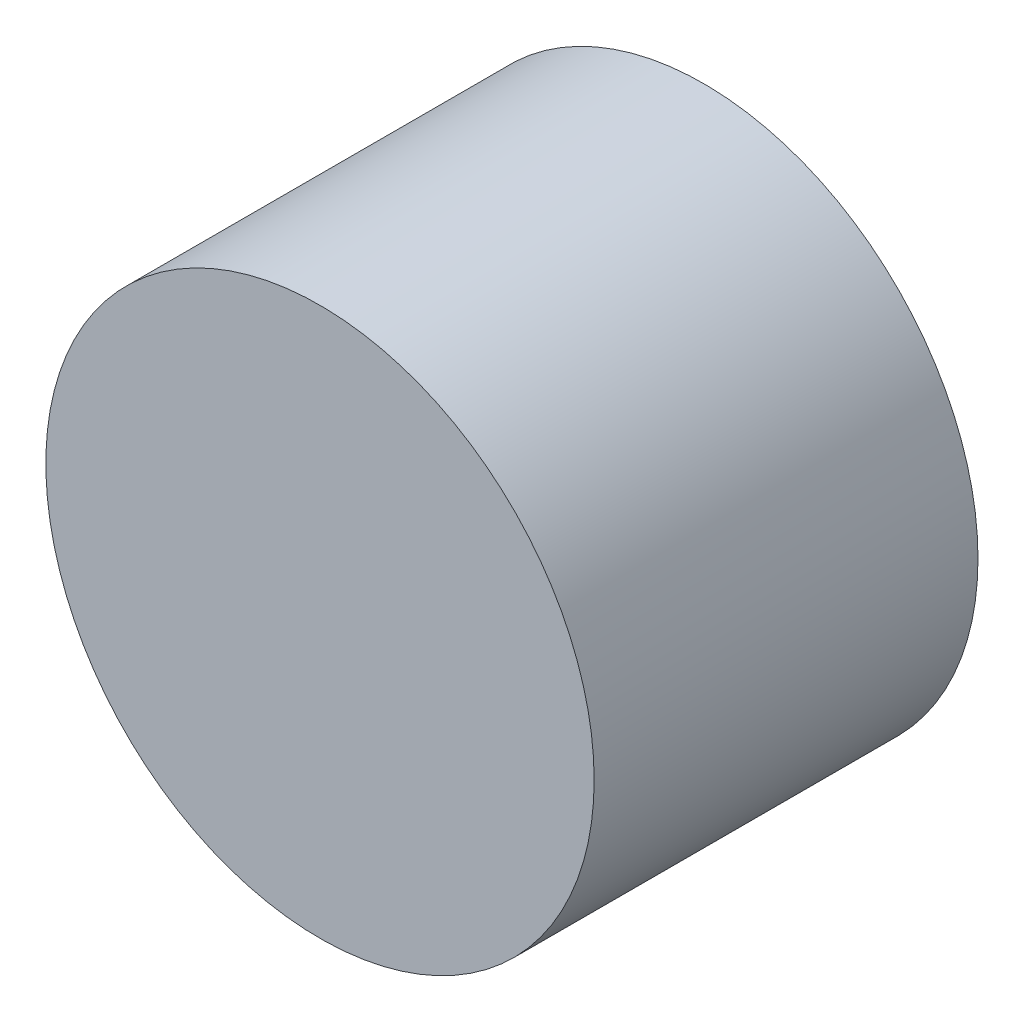
ISO-10303-21;
HEADER;
FILE_DESCRIPTION(('STEP AP214'),'2;1');
FILE_NAME('part.step','',(''),(''),'','','');
FILE_SCHEMA(('AUTOMOTIVE_DESIGN { 1 0 10303 214 1 1 1 1 }'));
ENDSEC;
DATA;
#1=APPLICATION_CONTEXT('core data for automotive mechanical design processes');
#2=APPLICATION_PROTOCOL_DEFINITION('international standard','automotive_design',2000,#1);
#3=PRODUCT_CONTEXT('',#1,'mechanical');
#4=PRODUCT('Part','Part','',(#3));
#5=PRODUCT_RELATED_PRODUCT_CATEGORY('part','',(#4));
#6=PRODUCT_DEFINITION_FORMATION('','',#4);
#7=PRODUCT_DEFINITION_CONTEXT('part definition',#1,'design');
#8=PRODUCT_DEFINITION('design','',#6,#7);
#9=PRODUCT_DEFINITION_SHAPE('','',#8);
#10=(LENGTH_UNIT() NAMED_UNIT(*) SI_UNIT(.MILLI.,.METRE.));
#11=(NAMED_UNIT(*) PLANE_ANGLE_UNIT() SI_UNIT($,.RADIAN.));
#12=(NAMED_UNIT(*) SI_UNIT($,.STERADIAN.) SOLID_ANGLE_UNIT());
#13=UNCERTAINTY_MEASURE_WITH_UNIT(LENGTH_MEASURE(1.E-05),#10,'distance_accuracy_value','');
#14=(GEOMETRIC_REPRESENTATION_CONTEXT(3) GLOBAL_UNCERTAINTY_ASSIGNED_CONTEXT((#13)) GLOBAL_UNIT_ASSIGNED_CONTEXT((#10,
#11,#12)) REPRESENTATION_CONTEXT('',''));
#15=CARTESIAN_POINT('',(0.,0.,0.));
#16=DIRECTION('',(0.,0.,1.));
#17=DIRECTION('',(1.,0.,0.));
#18=AXIS2_PLACEMENT_3D('',#15,#16,#17);
#19=CARTESIAN_POINT('',(0.,0.,8.89));
#20=DIRECTION('',(0.,0.,-1.));
#21=DIRECTION('',(-1.,0.,0.));
#22=AXIS2_PLACEMENT_3D('',#19,#20,#21);
#23=CYLINDRICAL_SURFACE('',#22,6.35);
#24=CARTESIAN_POINT('',(0.,0.,8.89));
#25=DIRECTION('',(0.,0.,1.));
#26=DIRECTION('',(1.,0.,0.));
#27=AXIS2_PLACEMENT_3D('',#24,#25,#26);
#28=CIRCLE('',#27,6.35);
#29=CARTESIAN_POINT('',(6.35,0.,8.89));
#30=VERTEX_POINT('',#29);
#31=EDGE_CURVE('E10',#30,#30,#28,.T.);
#32=ORIENTED_EDGE('',*,*,#31,.F.);
#33=EDGE_LOOP('',(#32));
#34=FACE_BOUND('',#33,.T.);
#35=CARTESIAN_POINT('',(0.,0.,0.));
#36=DIRECTION('',(0.,0.,1.));
#37=DIRECTION('',(1.,0.,0.));
#38=AXIS2_PLACEMENT_3D('',#35,#36,#37);
#39=CIRCLE('',#38,6.35);
#40=CARTESIAN_POINT('',(6.35,0.,0.));
#41=VERTEX_POINT('',#40);
#42=EDGE_CURVE('E34',#41,#41,#39,.T.);
#43=ORIENTED_EDGE('',*,*,#42,.T.);
#44=EDGE_LOOP('',(#43));
#45=FACE_BOUND('',#44,.T.);
#46=ADVANCED_FACE('F31',(#34,#45),#23,.T.);
#47=CARTESIAN_POINT('',(0.,0.,8.89));
#48=DIRECTION('',(0.,0.,1.));
#49=DIRECTION('',(1.,0.,0.));
#50=AXIS2_PLACEMENT_3D('',#47,#48,#49);
#51=PLANE('',#50);
#52=ORIENTED_EDGE('',*,*,#31,.T.);
#53=EDGE_LOOP('',(#52));
#54=FACE_BOUND('',#53,.T.);
#55=ADVANCED_FACE('F46',(#54),#51,.T.);
#56=CARTESIAN_POINT('',(0.,0.,0.));
#57=DIRECTION('',(0.,0.,1.));
#58=DIRECTION('',(1.,0.,0.));
#59=AXIS2_PLACEMENT_3D('',#56,#57,#58);
#60=PLANE('',#59);
#61=ORIENTED_EDGE('',*,*,#42,.F.);
#62=EDGE_LOOP('',(#61));
#63=FACE_BOUND('',#62,.T.);
#64=ADVANCED_FACE('F44',(#63),#60,.F.);
#65=CLOSED_SHELL('',(#46,#55,#64));
#66=MANIFOLD_SOLID_BREP('B2',#65);
#67=ADVANCED_BREP_SHAPE_REPRESENTATION('',(#18,#66),#14);
#68=SHAPE_DEFINITION_REPRESENTATION(#9,#67);
ENDSEC;
END-ISO-10303-21;
